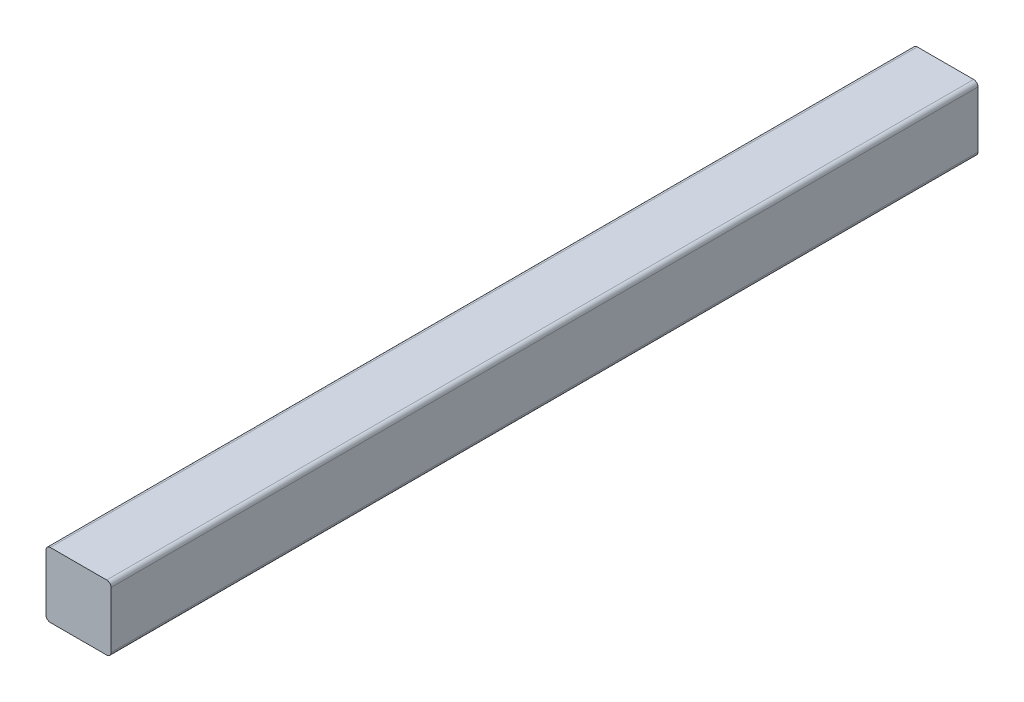
ISO-10303-21;
HEADER;
FILE_DESCRIPTION(('STEP AP214'),'2;1');
FILE_NAME('part.step','',(''),(''),'','','');
FILE_SCHEMA(('AUTOMOTIVE_DESIGN { 1 0 10303 214 1 1 1 1 }'));
ENDSEC;
DATA;
#1=APPLICATION_CONTEXT('core data for automotive mechanical design processes');
#2=APPLICATION_PROTOCOL_DEFINITION('international standard','automotive_design',2000,#1);
#3=PRODUCT_CONTEXT('',#1,'mechanical');
#4=PRODUCT('Part','Part','',(#3));
#5=PRODUCT_RELATED_PRODUCT_CATEGORY('part','',(#4));
#6=PRODUCT_DEFINITION_FORMATION('','',#4);
#7=PRODUCT_DEFINITION_CONTEXT('part definition',#1,'design');
#8=PRODUCT_DEFINITION('design','',#6,#7);
#9=PRODUCT_DEFINITION_SHAPE('','',#8);
#10=(LENGTH_UNIT() NAMED_UNIT(*) SI_UNIT(.MILLI.,.METRE.));
#11=(NAMED_UNIT(*) PLANE_ANGLE_UNIT() SI_UNIT($,.RADIAN.));
#12=(NAMED_UNIT(*) SI_UNIT($,.STERADIAN.) SOLID_ANGLE_UNIT());
#13=UNCERTAINTY_MEASURE_WITH_UNIT(LENGTH_MEASURE(1.E-05),#10,'distance_accuracy_value','');
#14=(GEOMETRIC_REPRESENTATION_CONTEXT(3) GLOBAL_UNCERTAINTY_ASSIGNED_CONTEXT((#13)) GLOBAL_UNIT_ASSIGNED_CONTEXT((#10,
#11,#12)) REPRESENTATION_CONTEXT('',''));
#15=CARTESIAN_POINT('',(0.,0.,0.));
#16=DIRECTION('',(0.,0.,1.));
#17=DIRECTION('',(1.,0.,0.));
#18=AXIS2_PLACEMENT_3D('',#15,#16,#17);
#19=CARTESIAN_POINT('',(2.,2.,400.));
#20=DIRECTION('',(0.,0.,-1.));
#21=DIRECTION('',(-1.,0.,0.));
#22=AXIS2_PLACEMENT_3D('',#19,#20,#21);
#23=CYLINDRICAL_SURFACE('',#22,2.);
#24=CARTESIAN_POINT('',(2.,2.,0.));
#25=DIRECTION('',(0.,0.,1.));
#26=DIRECTION('',(-1.,0.,0.));
#27=AXIS2_PLACEMENT_3D('',#24,#25,#26);
#28=CIRCLE('',#27,2.);
#29=CARTESIAN_POINT('',(0.,2.00000000000001,0.));
#30=VERTEX_POINT('',#29);
#31=CARTESIAN_POINT('',(2.00000000000001,0.,0.));
#32=VERTEX_POINT('',#31);
#33=EDGE_CURVE('E128',#30,#32,#28,.T.);
#34=ORIENTED_EDGE('',*,*,#33,.T.);
#35=DIRECTION('',(0.,0.,-1.));
#36=VECTOR('',#35,1.);
#37=CARTESIAN_POINT('',(2.00000000000001,0.,400.));
#38=LINE('',#37,#36);
#39=CARTESIAN_POINT('',(2.00000000000001,0.,400.));
#40=VERTEX_POINT('',#39);
#41=EDGE_CURVE('E11',#40,#32,#38,.T.);
#42=ORIENTED_EDGE('',*,*,#41,.F.);
#43=CARTESIAN_POINT('',(2.,2.,400.));
#44=DIRECTION('',(0.,0.,1.));
#45=DIRECTION('',(-1.,0.,0.));
#46=AXIS2_PLACEMENT_3D('',#43,#44,#45);
#47=CIRCLE('',#46,2.);
#48=CARTESIAN_POINT('',(0.,2.00000000000001,400.));
#49=VERTEX_POINT('',#48);
#50=EDGE_CURVE('E142',#49,#40,#47,.T.);
#51=ORIENTED_EDGE('',*,*,#50,.F.);
#52=DIRECTION('',(0.,0.,-1.));
#53=VECTOR('',#52,1.);
#54=CARTESIAN_POINT('',(0.,2.00000000000001,400.));
#55=LINE('',#54,#53);
#56=EDGE_CURVE('E124',#49,#30,#55,.T.);
#57=ORIENTED_EDGE('',*,*,#56,.T.);
#58=EDGE_LOOP('',(#34,#42,#51,#57));
#59=FACE_BOUND('',#58,.T.);
#60=ADVANCED_FACE('F32',(#59),#23,.T.);
#61=CARTESIAN_POINT('',(2.00000000000001,0.,400.));
#62=DIRECTION('',(0.,1.,0.));
#63=DIRECTION('',(0.,0.,1.));
#64=AXIS2_PLACEMENT_3D('',#61,#62,#63);
#65=PLANE('',#64);
#66=DIRECTION('',(1.,0.,0.));
#67=VECTOR('',#66,1.);
#68=CARTESIAN_POINT('',(2.00000000000001,0.,0.));
#69=LINE('',#68,#67);
#70=CARTESIAN_POINT('',(28.,0.,0.));
#71=VERTEX_POINT('',#70);
#72=EDGE_CURVE('E131',#32,#71,#69,.T.);
#73=ORIENTED_EDGE('',*,*,#72,.T.);
#74=DIRECTION('',(0.,0.,-1.));
#75=VECTOR('',#74,1.);
#76=CARTESIAN_POINT('',(28.,0.,400.));
#77=LINE('',#76,#75);
#78=CARTESIAN_POINT('',(28.,0.,400.));
#79=VERTEX_POINT('',#78);
#80=EDGE_CURVE('E40',#79,#71,#77,.T.);
#81=ORIENTED_EDGE('',*,*,#80,.F.);
#82=DIRECTION('',(1.,0.,0.));
#83=VECTOR('',#82,1.);
#84=CARTESIAN_POINT('',(2.00000000000001,0.,400.));
#85=LINE('',#84,#83);
#86=EDGE_CURVE('E91',#40,#79,#85,.T.);
#87=ORIENTED_EDGE('',*,*,#86,.F.);
#88=ORIENTED_EDGE('',*,*,#41,.T.);
#89=EDGE_LOOP('',(#73,#81,#87,#88));
#90=FACE_BOUND('',#89,.T.);
#91=ADVANCED_FACE('F177',(#90),#65,.F.);
#92=CARTESIAN_POINT('',(28.,2.,400.));
#93=DIRECTION('',(0.,0.,-1.));
#94=DIRECTION('',(-1.,0.,0.));
#95=AXIS2_PLACEMENT_3D('',#92,#93,#94);
#96=CYLINDRICAL_SURFACE('',#95,2.);
#97=CARTESIAN_POINT('',(28.,2.,0.));
#98=DIRECTION('',(0.,0.,1.));
#99=DIRECTION('',(-1.,0.,0.));
#100=AXIS2_PLACEMENT_3D('',#97,#98,#99);
#101=CIRCLE('',#100,2.);
#102=CARTESIAN_POINT('',(30.,2.00000000000001,0.));
#103=VERTEX_POINT('',#102);
#104=EDGE_CURVE('E133',#71,#103,#101,.T.);
#105=ORIENTED_EDGE('',*,*,#104,.T.);
#106=DIRECTION('',(0.,0.,-1.));
#107=VECTOR('',#106,1.);
#108=CARTESIAN_POINT('',(30.,2.00000000000001,400.));
#109=LINE('',#108,#107);
#110=CARTESIAN_POINT('',(30.,2.00000000000001,400.));
#111=VERTEX_POINT('',#110);
#112=EDGE_CURVE('E149',#111,#103,#109,.T.);
#113=ORIENTED_EDGE('',*,*,#112,.F.);
#114=CARTESIAN_POINT('',(28.,2.,400.));
#115=DIRECTION('',(0.,0.,1.));
#116=DIRECTION('',(-1.,0.,0.));
#117=AXIS2_PLACEMENT_3D('',#114,#115,#116);
#118=CIRCLE('',#117,2.);
#119=EDGE_CURVE('E157',#79,#111,#118,.T.);
#120=ORIENTED_EDGE('',*,*,#119,.F.);
#121=ORIENTED_EDGE('',*,*,#80,.T.);
#122=EDGE_LOOP('',(#105,#113,#120,#121));
#123=FACE_BOUND('',#122,.T.);
#124=ADVANCED_FACE('F155',(#123),#96,.T.);
#125=CARTESIAN_POINT('',(30.,2.00000000000001,400.));
#126=DIRECTION('',(-1.,0.,0.));
#127=DIRECTION('',(0.,0.,1.));
#128=AXIS2_PLACEMENT_3D('',#125,#126,#127);
#129=PLANE('',#128);
#130=DIRECTION('',(0.,1.,0.));
#131=VECTOR('',#130,1.);
#132=CARTESIAN_POINT('',(30.,2.00000000000001,0.));
#133=LINE('',#132,#131);
#134=CARTESIAN_POINT('',(30.,28.,0.));
#135=VERTEX_POINT('',#134);
#136=EDGE_CURVE('E135',#103,#135,#133,.T.);
#137=ORIENTED_EDGE('',*,*,#136,.T.);
#138=DIRECTION('',(0.,0.,-1.));
#139=VECTOR('',#138,1.);
#140=CARTESIAN_POINT('',(30.,28.,400.));
#141=LINE('',#140,#139);
#142=CARTESIAN_POINT('',(30.,28.,400.));
#143=VERTEX_POINT('',#142);
#144=EDGE_CURVE('E146',#143,#135,#141,.T.);
#145=ORIENTED_EDGE('',*,*,#144,.F.);
#146=DIRECTION('',(0.,1.,0.));
#147=VECTOR('',#146,1.);
#148=CARTESIAN_POINT('',(30.,2.00000000000001,400.));
#149=LINE('',#148,#147);
#150=EDGE_CURVE('E169',#111,#143,#149,.T.);
#151=ORIENTED_EDGE('',*,*,#150,.F.);
#152=ORIENTED_EDGE('',*,*,#112,.T.);
#153=EDGE_LOOP('',(#137,#145,#151,#152));
#154=FACE_BOUND('',#153,.T.);
#155=ADVANCED_FACE('F165',(#154),#129,.F.);
#156=CARTESIAN_POINT('',(28.,28.,400.));
#157=DIRECTION('',(0.,0.,-1.));
#158=DIRECTION('',(-1.,0.,0.));
#159=AXIS2_PLACEMENT_3D('',#156,#157,#158);
#160=CYLINDRICAL_SURFACE('',#159,2.);
#161=CARTESIAN_POINT('',(28.,28.,0.));
#162=DIRECTION('',(0.,0.,1.));
#163=DIRECTION('',(-1.,0.,0.));
#164=AXIS2_PLACEMENT_3D('',#161,#162,#163);
#165=CIRCLE('',#164,2.);
#166=CARTESIAN_POINT('',(28.,30.,0.));
#167=VERTEX_POINT('',#166);
#168=EDGE_CURVE('E137',#135,#167,#165,.T.);
#169=ORIENTED_EDGE('',*,*,#168,.T.);
#170=DIRECTION('',(0.,0.,-1.));
#171=VECTOR('',#170,1.);
#172=CARTESIAN_POINT('',(28.,30.,400.));
#173=LINE('',#172,#171);
#174=CARTESIAN_POINT('',(28.,30.,400.));
#175=VERTEX_POINT('',#174);
#176=EDGE_CURVE('E119',#175,#167,#173,.T.);
#177=ORIENTED_EDGE('',*,*,#176,.F.);
#178=CARTESIAN_POINT('',(28.,28.,400.));
#179=DIRECTION('',(0.,0.,1.));
#180=DIRECTION('',(-1.,0.,0.));
#181=AXIS2_PLACEMENT_3D('',#178,#179,#180);
#182=CIRCLE('',#181,2.);
#183=EDGE_CURVE('E110',#143,#175,#182,.T.);
#184=ORIENTED_EDGE('',*,*,#183,.F.);
#185=ORIENTED_EDGE('',*,*,#144,.T.);
#186=EDGE_LOOP('',(#169,#177,#184,#185));
#187=FACE_BOUND('',#186,.T.);
#188=ADVANCED_FACE('F168',(#187),#160,.T.);
#189=CARTESIAN_POINT('',(28.,30.,400.));
#190=DIRECTION('',(0.,-1.,0.));
#191=DIRECTION('',(0.,0.,-1.));
#192=AXIS2_PLACEMENT_3D('',#189,#190,#191);
#193=PLANE('',#192);
#194=DIRECTION('',(-1.,0.,0.));
#195=VECTOR('',#194,1.);
#196=CARTESIAN_POINT('',(28.,30.,0.));
#197=LINE('',#196,#195);
#198=CARTESIAN_POINT('',(2.00000000000001,30.,0.));
#199=VERTEX_POINT('',#198);
#200=EDGE_CURVE('E118',#167,#199,#197,.T.);
#201=ORIENTED_EDGE('',*,*,#200,.T.);
#202=DIRECTION('',(0.,0.,-1.));
#203=VECTOR('',#202,1.);
#204=CARTESIAN_POINT('',(2.00000000000001,30.,400.));
#205=LINE('',#204,#203);
#206=CARTESIAN_POINT('',(2.00000000000001,30.,400.));
#207=VERTEX_POINT('',#206);
#208=EDGE_CURVE('E115',#207,#199,#205,.T.);
#209=ORIENTED_EDGE('',*,*,#208,.F.);
#210=DIRECTION('',(-1.,0.,0.));
#211=VECTOR('',#210,1.);
#212=CARTESIAN_POINT('',(28.,30.,400.));
#213=LINE('',#212,#211);
#214=EDGE_CURVE('E104',#175,#207,#213,.T.);
#215=ORIENTED_EDGE('',*,*,#214,.F.);
#216=ORIENTED_EDGE('',*,*,#176,.T.);
#217=EDGE_LOOP('',(#201,#209,#215,#216));
#218=FACE_BOUND('',#217,.T.);
#219=ADVANCED_FACE('F116',(#218),#193,.F.);
#220=CARTESIAN_POINT('',(2.,28.,400.));
#221=DIRECTION('',(0.,0.,-1.));
#222=DIRECTION('',(-1.,0.,0.));
#223=AXIS2_PLACEMENT_3D('',#220,#221,#222);
#224=CYLINDRICAL_SURFACE('',#223,2.);
#225=CARTESIAN_POINT('',(2.,28.,0.));
#226=DIRECTION('',(0.,0.,1.));
#227=DIRECTION('',(-1.,0.,0.));
#228=AXIS2_PLACEMENT_3D('',#225,#226,#227);
#229=CIRCLE('',#228,2.);
#230=CARTESIAN_POINT('',(0.,28.,0.));
#231=VERTEX_POINT('',#230);
#232=EDGE_CURVE('E77',#199,#231,#229,.T.);
#233=ORIENTED_EDGE('',*,*,#232,.T.);
#234=DIRECTION('',(0.,0.,-1.));
#235=VECTOR('',#234,1.);
#236=CARTESIAN_POINT('',(0.,28.,400.));
#237=LINE('',#236,#235);
#238=CARTESIAN_POINT('',(0.,28.,400.));
#239=VERTEX_POINT('',#238);
#240=EDGE_CURVE('E120',#239,#231,#237,.T.);
#241=ORIENTED_EDGE('',*,*,#240,.F.);
#242=CARTESIAN_POINT('',(2.,28.,400.));
#243=DIRECTION('',(0.,0.,1.));
#244=DIRECTION('',(-1.,0.,0.));
#245=AXIS2_PLACEMENT_3D('',#242,#243,#244);
#246=CIRCLE('',#245,2.);
#247=EDGE_CURVE('E108',#207,#239,#246,.T.);
#248=ORIENTED_EDGE('',*,*,#247,.F.);
#249=ORIENTED_EDGE('',*,*,#208,.T.);
#250=EDGE_LOOP('',(#233,#241,#248,#249));
#251=FACE_BOUND('',#250,.T.);
#252=ADVANCED_FACE('F122',(#251),#224,.T.);
#253=CARTESIAN_POINT('',(0.,28.,400.));
#254=DIRECTION('',(1.,0.,0.));
#255=DIRECTION('',(0.,0.,-1.));
#256=AXIS2_PLACEMENT_3D('',#253,#254,#255);
#257=PLANE('',#256);
#258=DIRECTION('',(0.,-1.,0.));
#259=VECTOR('',#258,1.);
#260=CARTESIAN_POINT('',(0.,28.,0.));
#261=LINE('',#260,#259);
#262=EDGE_CURVE('E83',#231,#30,#261,.T.);
#263=ORIENTED_EDGE('',*,*,#262,.T.);
#264=ORIENTED_EDGE('',*,*,#56,.F.);
#265=DIRECTION('',(0.,-1.,0.));
#266=VECTOR('',#265,1.);
#267=CARTESIAN_POINT('',(0.,28.,400.));
#268=LINE('',#267,#266);
#269=EDGE_CURVE('E48',#239,#49,#268,.T.);
#270=ORIENTED_EDGE('',*,*,#269,.F.);
#271=ORIENTED_EDGE('',*,*,#240,.T.);
#272=EDGE_LOOP('',(#263,#264,#270,#271));
#273=FACE_BOUND('',#272,.T.);
#274=ADVANCED_FACE('F193',(#273),#257,.F.);
#275=CARTESIAN_POINT('',(2.,2.,400.));
#276=DIRECTION('',(0.,0.,-1.));
#277=DIRECTION('',(-1.,0.,0.));
#278=AXIS2_PLACEMENT_3D('',#275,#276,#277);
#279=PLANE('',#278);
#280=ORIENTED_EDGE('',*,*,#50,.T.);
#281=ORIENTED_EDGE('',*,*,#86,.T.);
#282=ORIENTED_EDGE('',*,*,#119,.T.);
#283=ORIENTED_EDGE('',*,*,#150,.T.);
#284=ORIENTED_EDGE('',*,*,#183,.T.);
#285=ORIENTED_EDGE('',*,*,#214,.T.);
#286=ORIENTED_EDGE('',*,*,#247,.T.);
#287=ORIENTED_EDGE('',*,*,#269,.T.);
#288=EDGE_LOOP('',(#280,#281,#282,#283,#284,#285,#286,#287));
#289=FACE_BOUND('',#288,.T.);
#290=ADVANCED_FACE('F106',(#289),#279,.F.);
#291=CARTESIAN_POINT('',(2.,2.,0.));
#292=DIRECTION('',(0.,0.,-1.));
#293=DIRECTION('',(-1.,0.,0.));
#294=AXIS2_PLACEMENT_3D('',#291,#292,#293);
#295=PLANE('',#294);
#296=ORIENTED_EDGE('',*,*,#33,.F.);
#297=ORIENTED_EDGE('',*,*,#262,.F.);
#298=ORIENTED_EDGE('',*,*,#232,.F.);
#299=ORIENTED_EDGE('',*,*,#200,.F.);
#300=ORIENTED_EDGE('',*,*,#168,.F.);
#301=ORIENTED_EDGE('',*,*,#136,.F.);
#302=ORIENTED_EDGE('',*,*,#104,.F.);
#303=ORIENTED_EDGE('',*,*,#72,.F.);
#304=EDGE_LOOP('',(#296,#297,#298,#299,#300,#301,#302,#303));
#305=FACE_BOUND('',#304,.T.);
#306=ADVANCED_FACE('F161',(#305),#295,.T.);
#307=CLOSED_SHELL('',(#60,#91,#124,#155,#188,#219,#252,#274,#290,#306));
#308=MANIFOLD_SOLID_BREP('B2',#307);
#309=ADVANCED_BREP_SHAPE_REPRESENTATION('',(#18,#308),#14);
#310=SHAPE_DEFINITION_REPRESENTATION(#9,#309);
ENDSEC;
END-ISO-10303-21;
